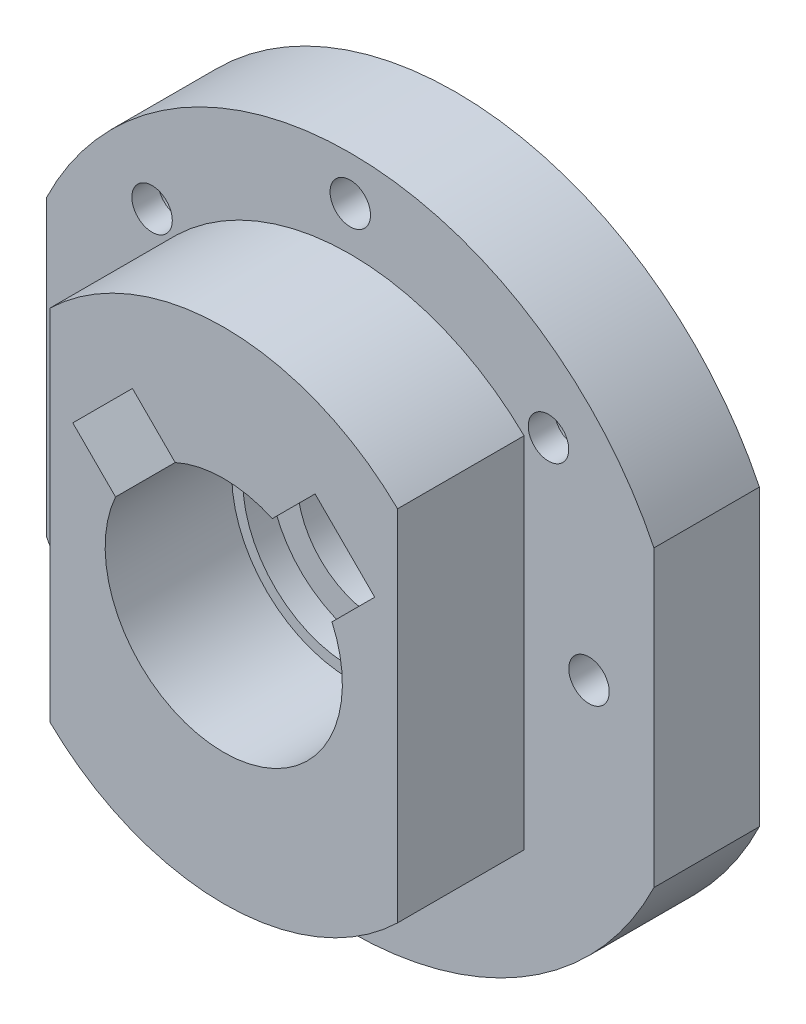
ISO-10303-21;
HEADER;
FILE_DESCRIPTION(('STEP AP214'),'2;1');
FILE_NAME('part.step','',(''),(''),'','','');
FILE_SCHEMA(('AUTOMOTIVE_DESIGN { 1 0 10303 214 1 1 1 1 }'));
ENDSEC;
DATA;
#1=APPLICATION_CONTEXT('core data for automotive mechanical design processes');
#2=APPLICATION_PROTOCOL_DEFINITION('international standard','automotive_design',2000,#1);
#3=PRODUCT_CONTEXT('',#1,'mechanical');
#4=PRODUCT('Part','Part','',(#3));
#5=PRODUCT_RELATED_PRODUCT_CATEGORY('part','',(#4));
#6=PRODUCT_DEFINITION_FORMATION('','',#4);
#7=PRODUCT_DEFINITION_CONTEXT('part definition',#1,'design');
#8=PRODUCT_DEFINITION('design','',#6,#7);
#9=PRODUCT_DEFINITION_SHAPE('','',#8);
#10=(LENGTH_UNIT() NAMED_UNIT(*) SI_UNIT(.MILLI.,.METRE.));
#11=(NAMED_UNIT(*) PLANE_ANGLE_UNIT() SI_UNIT($,.RADIAN.));
#12=(NAMED_UNIT(*) SI_UNIT($,.STERADIAN.) SOLID_ANGLE_UNIT());
#13=UNCERTAINTY_MEASURE_WITH_UNIT(LENGTH_MEASURE(1.E-05),#10,'distance_accuracy_value','');
#14=(GEOMETRIC_REPRESENTATION_CONTEXT(3) GLOBAL_UNCERTAINTY_ASSIGNED_CONTEXT((#13)) GLOBAL_UNIT_ASSIGNED_CONTEXT((#10,
#11,#12)) REPRESENTATION_CONTEXT('',''));
#15=CARTESIAN_POINT('',(0.,0.,0.));
#16=DIRECTION('',(0.,0.,1.));
#17=DIRECTION('',(1.,0.,0.));
#18=AXIS2_PLACEMENT_3D('',#15,#16,#17);
#19=CARTESIAN_POINT('',(5.50040687416928,9.09250932257285,-7.9375));
#20=DIRECTION('',(-0.707106781187582,-0.707106781185513,0.));
#21=DIRECTION('',(0.707106781185513,-0.707106781187582,0.));
#22=AXIS2_PLACEMENT_3D('',#19,#20,#21);
#23=PLANE('',#22);
#24=DIRECTION('',(0.707106781185515,-0.70710678118758,0.));
#25=VECTOR('',#24,1.);
#26=CARTESIAN_POINT('',(5.50040687416925,9.09250932257285,-0.317499999999994));
#27=LINE('',#26,#25);
#28=CARTESIAN_POINT('',(5.50040687416925,9.09250932257286,-0.317499999999994));
#29=VERTEX_POINT('',#28);
#30=CARTESIAN_POINT('',(9.09250932258649,5.50040687414512,-0.317499999999992));
#31=VERTEX_POINT('',#30);
#32=EDGE_CURVE('E125',#29,#31,#27,.T.);
#33=ORIENTED_EDGE('',*,*,#32,.F.);
#34=DIRECTION('',(0.,0.,1.));
#35=VECTOR('',#34,1.);
#36=CARTESIAN_POINT('',(5.50040687416926,9.09250932257286,-7.9375));
#37=LINE('',#36,#35);
#38=CARTESIAN_POINT('',(5.50040687416927,9.09250932257285,-7.9375));
#39=VERTEX_POINT('',#38);
#40=EDGE_CURVE('E138',#39,#29,#37,.T.);
#41=ORIENTED_EDGE('',*,*,#40,.F.);
#42=DIRECTION('',(0.707106781185515,-0.70710678118758,0.));
#43=VECTOR('',#42,1.);
#44=CARTESIAN_POINT('',(5.50040687416928,9.09250932257285,-7.9375));
#45=LINE('',#44,#43);
#46=CARTESIAN_POINT('',(9.09250932258651,5.50040687414512,-7.93749999999999));
#47=VERTEX_POINT('',#46);
#48=EDGE_CURVE('E137',#39,#47,#45,.T.);
#49=ORIENTED_EDGE('',*,*,#48,.T.);
#50=DIRECTION('',(0.,0.,1.));
#51=VECTOR('',#50,1.);
#52=CARTESIAN_POINT('',(9.0925093225865,5.50040687414511,-7.9375));
#53=LINE('',#52,#51);
#54=EDGE_CURVE('E121',#31,#47,#53,.F.);
#55=ORIENTED_EDGE('',*,*,#54,.F.);
#56=EDGE_LOOP('',(#33,#41,#49,#55));
#57=FACE_BOUND('',#56,.T.);
#58=ADVANCED_FACE('F16',(#57),#23,.T.);
#59=CARTESIAN_POINT('',(9.09250932258651,5.50040687414512,-7.9375));
#60=DIRECTION('',(-0.707106781185299,0.707106781187796,0.));
#61=DIRECTION('',(-0.707106781187796,-0.707106781185299,0.));
#62=AXIS2_PLACEMENT_3D('',#59,#60,#61);
#63=PLANE('',#62);
#64=DIRECTION('',(-0.707106781187793,-0.707106781185303,0.));
#65=VECTOR('',#64,1.);
#66=CARTESIAN_POINT('',(9.09250932258649,5.50040687414512,-0.317499999999991));
#67=LINE('',#66,#65);
#68=CARTESIAN_POINT('',(6.51736269786849,2.92526024943633,-0.317499999999995));
#69=VERTEX_POINT('',#68);
#70=EDGE_CURVE('E148',#31,#69,#67,.T.);
#71=ORIENTED_EDGE('',*,*,#70,.F.);
#72=ORIENTED_EDGE('',*,*,#54,.T.);
#73=DIRECTION('',(-0.707106781187796,-0.707106781185299,0.));
#74=VECTOR('',#73,1.);
#75=CARTESIAN_POINT('',(9.09250932258651,5.50040687414512,-7.93749999999999));
#76=LINE('',#75,#74);
#77=CARTESIAN_POINT('',(6.5173626978685,2.92526024943633,-7.93749999999999));
#78=VERTEX_POINT('',#77);
#79=EDGE_CURVE('E143',#47,#78,#76,.T.);
#80=ORIENTED_EDGE('',*,*,#79,.T.);
#81=DIRECTION('',(0.,0.,1.));
#82=VECTOR('',#81,1.);
#83=CARTESIAN_POINT('',(6.51736269786846,2.92526024943642,-7.93749999999999));
#84=LINE('',#83,#82);
#85=EDGE_CURVE('E111',#78,#69,#84,.T.);
#86=ORIENTED_EDGE('',*,*,#85,.T.);
#87=EDGE_LOOP('',(#71,#72,#80,#86));
#88=FACE_BOUND('',#87,.T.);
#89=ADVANCED_FACE('F146',(#88),#63,.T.);
#90=CARTESIAN_POINT('',(0.,0.,-7.9375));
#91=DIRECTION('',(0.,0.,1.));
#92=DIRECTION('',(1.,0.,0.));
#93=AXIS2_PLACEMENT_3D('',#90,#91,#92);
#94=CYLINDRICAL_SURFACE('',#93,7.14375);
#95=DIRECTION('',(0.,0.,1.));
#96=VECTOR('',#95,1.);
#97=CARTESIAN_POINT('',(-6.51736269786507,2.92526024944395,-7.9375));
#98=LINE('',#97,#96);
#99=CARTESIAN_POINT('',(-6.51736269786507,2.92526024944395,-0.317500000000004));
#100=VERTEX_POINT('',#99);
#101=CARTESIAN_POINT('',(-6.51736269786507,2.92526024944395,-7.9375));
#102=VERTEX_POINT('',#101);
#103=EDGE_CURVE('E215',#100,#102,#98,.F.);
#104=ORIENTED_EDGE('',*,*,#103,.F.);
#105=CARTESIAN_POINT('',(0.,0.,-0.317499999999999));
#106=DIRECTION('',(0.,0.,1.));
#107=DIRECTION('',(1.,0.,0.));
#108=AXIS2_PLACEMENT_3D('',#105,#106,#107);
#109=CIRCLE('',#108,7.14375);
#110=EDGE_CURVE('E19',#69,#100,#109,.F.);
#111=ORIENTED_EDGE('',*,*,#110,.F.);
#112=ORIENTED_EDGE('',*,*,#85,.F.);
#113=CARTESIAN_POINT('',(0.,0.,-7.93749999999999));
#114=DIRECTION('',(0.,0.,1.));
#115=DIRECTION('',(1.,0.,0.));
#116=AXIS2_PLACEMENT_3D('',#113,#114,#115);
#117=CIRCLE('',#116,7.14375);
#118=EDGE_CURVE('E154',#78,#102,#117,.F.);
#119=ORIENTED_EDGE('',*,*,#118,.T.);
#120=EDGE_LOOP('',(#104,#111,#112,#119));
#121=FACE_BOUND('',#120,.T.);
#122=ADVANCED_FACE('F352',(#121),#94,.F.);
#123=CARTESIAN_POINT('',(-6.51736269786507,2.92526024944395,-7.9375));
#124=DIRECTION('',(0.707106781186548,0.707106781186547,0.));
#125=DIRECTION('',(-0.707106781186547,0.707106781186548,0.));
#126=AXIS2_PLACEMENT_3D('',#123,#124,#125);
#127=PLANE('',#126);
#128=DIRECTION('',(-0.707106781186548,0.707106781186548,0.));
#129=VECTOR('',#128,1.);
#130=CARTESIAN_POINT('',(-6.51736269786507,2.92526024944395,-0.317500000000002));
#131=LINE('',#130,#129);
#132=CARTESIAN_POINT('',(-9.09250932257925,5.50040687415812,-0.317500000000003));
#133=VERTEX_POINT('',#132);
#134=EDGE_CURVE('E180',#100,#133,#131,.T.);
#135=ORIENTED_EDGE('',*,*,#134,.F.);
#136=ORIENTED_EDGE('',*,*,#103,.T.);
#137=DIRECTION('',(-0.707106781186544,0.707106781186551,0.));
#138=VECTOR('',#137,1.);
#139=CARTESIAN_POINT('',(-6.51736269786507,2.92526024944395,-7.93750000000001));
#140=LINE('',#139,#138);
#141=CARTESIAN_POINT('',(-9.09250932257923,5.50040687415812,-7.93750000000001));
#142=VERTEX_POINT('',#141);
#143=EDGE_CURVE('E156',#102,#142,#140,.T.);
#144=ORIENTED_EDGE('',*,*,#143,.T.);
#145=DIRECTION('',(0.,0.,1.));
#146=VECTOR('',#145,1.);
#147=CARTESIAN_POINT('',(-9.09250932257924,5.50040687415812,-7.9375));
#148=LINE('',#147,#146);
#149=EDGE_CURVE('E205',#133,#142,#148,.F.);
#150=ORIENTED_EDGE('',*,*,#149,.F.);
#151=EDGE_LOOP('',(#135,#136,#144,#150));
#152=FACE_BOUND('',#151,.T.);
#153=ADVANCED_FACE('F342',(#152),#127,.T.);
#154=CARTESIAN_POINT('',(-9.09250932257922,5.50040687415813,-7.9375));
#155=DIRECTION('',(0.707106781186549,-0.707106781186546,0.));
#156=DIRECTION('',(0.707106781186546,0.707106781186549,0.));
#157=AXIS2_PLACEMENT_3D('',#154,#155,#156);
#158=PLANE('',#157);
#159=DIRECTION('',(0.707106781186548,0.707106781186547,0.));
#160=VECTOR('',#159,1.);
#161=CARTESIAN_POINT('',(-9.09250932257925,5.50040687415813,-0.317500000000004));
#162=LINE('',#161,#160);
#163=CARTESIAN_POINT('',(-5.50040687415727,9.09250932258011,-0.317499999999998));
#164=VERTEX_POINT('',#163);
#165=EDGE_CURVE('E177',#133,#164,#162,.T.);
#166=ORIENTED_EDGE('',*,*,#165,.F.);
#167=ORIENTED_EDGE('',*,*,#149,.T.);
#168=DIRECTION('',(0.707106781186545,0.70710678118655,0.));
#169=VECTOR('',#168,1.);
#170=CARTESIAN_POINT('',(-9.09250932257922,5.50040687415813,-7.93750000000001));
#171=LINE('',#170,#169);
#172=CARTESIAN_POINT('',(-5.50040687415726,9.09250932258011,-7.9375));
#173=VERTEX_POINT('',#172);
#174=EDGE_CURVE('E208',#142,#173,#171,.T.);
#175=ORIENTED_EDGE('',*,*,#174,.T.);
#176=DIRECTION('',(0.,0.,1.));
#177=VECTOR('',#176,1.);
#178=CARTESIAN_POINT('',(-5.50040687415726,9.09250932258011,-7.9375));
#179=LINE('',#178,#177);
#180=EDGE_CURVE('E202',#164,#173,#179,.F.);
#181=ORIENTED_EDGE('',*,*,#180,.F.);
#182=EDGE_LOOP('',(#166,#167,#175,#181));
#183=FACE_BOUND('',#182,.T.);
#184=ADVANCED_FACE('F346',(#183),#158,.T.);
#185=CARTESIAN_POINT('',(-5.50040687415726,9.09250932258011,-7.9375));
#186=DIRECTION('',(-0.707106781186195,-0.7071067811869,0.));
#187=DIRECTION('',(0.7071067811869,-0.707106781186195,0.));
#188=AXIS2_PLACEMENT_3D('',#185,#186,#187);
#189=PLANE('',#188);
#190=DIRECTION('',(0.7071067811869,-0.707106781186195,0.));
#191=VECTOR('',#190,1.);
#192=CARTESIAN_POINT('',(-5.50040687415726,9.09250932258011,-0.317500000000001));
#193=LINE('',#192,#191);
#194=CARTESIAN_POINT('',(-2.92526024944099,6.5173626978664,-0.3175));
#195=VERTEX_POINT('',#194);
#196=EDGE_CURVE('E174',#164,#195,#193,.T.);
#197=ORIENTED_EDGE('',*,*,#196,.F.);
#198=ORIENTED_EDGE('',*,*,#180,.T.);
#199=DIRECTION('',(0.7071067811869,-0.707106781186195,0.));
#200=VECTOR('',#199,1.);
#201=CARTESIAN_POINT('',(-5.50040687415726,9.09250932258011,-7.9375));
#202=LINE('',#201,#200);
#203=CARTESIAN_POINT('',(-2.92526024944099,6.5173626978664,-7.9375));
#204=VERTEX_POINT('',#203);
#205=EDGE_CURVE('E210',#173,#204,#202,.T.);
#206=ORIENTED_EDGE('',*,*,#205,.T.);
#207=DIRECTION('',(0.,0.,1.));
#208=VECTOR('',#207,1.);
#209=CARTESIAN_POINT('',(-2.92526024944098,6.5173626978664,-7.9375));
#210=LINE('',#209,#208);
#211=EDGE_CURVE('E196',#204,#195,#210,.T.);
#212=ORIENTED_EDGE('',*,*,#211,.T.);
#213=EDGE_LOOP('',(#197,#198,#206,#212));
#214=FACE_BOUND('',#213,.T.);
#215=ADVANCED_FACE('F349',(#214),#189,.T.);
#216=CARTESIAN_POINT('',(0.,0.,-7.9375));
#217=DIRECTION('',(0.,0.,1.));
#218=DIRECTION('',(1.,0.,0.));
#219=AXIS2_PLACEMENT_3D('',#216,#217,#218);
#220=CYLINDRICAL_SURFACE('',#219,7.14375);
#221=DIRECTION('',(0.,0.,1.));
#222=VECTOR('',#221,1.);
#223=CARTESIAN_POINT('',(2.92526024944959,6.51736269786253,-7.9375));
#224=LINE('',#223,#222);
#225=CARTESIAN_POINT('',(2.92526024944959,6.51736269786254,-0.317499999999997));
#226=VERTEX_POINT('',#225);
#227=CARTESIAN_POINT('',(2.92526024944959,6.51736269786254,-7.9375));
#228=VERTEX_POINT('',#227);
#229=EDGE_CURVE('E192',#226,#228,#224,.F.);
#230=ORIENTED_EDGE('',*,*,#229,.F.);
#231=CARTESIAN_POINT('',(0.,0.,-0.317499999999998));
#232=DIRECTION('',(0.,0.,1.));
#233=DIRECTION('',(1.,0.,0.));
#234=AXIS2_PLACEMENT_3D('',#231,#232,#233);
#235=CIRCLE('',#234,7.14375);
#236=EDGE_CURVE('E171',#195,#226,#235,.F.);
#237=ORIENTED_EDGE('',*,*,#236,.F.);
#238=ORIENTED_EDGE('',*,*,#211,.F.);
#239=CARTESIAN_POINT('',(0.,0.,-7.9375));
#240=DIRECTION('',(0.,0.,1.));
#241=DIRECTION('',(1.,0.,0.));
#242=AXIS2_PLACEMENT_3D('',#239,#240,#241);
#243=CIRCLE('',#242,7.14375);
#244=EDGE_CURVE('E319',#204,#228,#243,.F.);
#245=ORIENTED_EDGE('',*,*,#244,.T.);
#246=EDGE_LOOP('',(#230,#237,#238,#245));
#247=FACE_BOUND('',#246,.T.);
#248=ADVANCED_FACE('F329',(#247),#220,.F.);
#249=CARTESIAN_POINT('',(2.92526024944959,6.51736269786253,-7.9375));
#250=DIRECTION('',(0.707106781185265,-0.70710678118783,0.));
#251=DIRECTION('',(0.70710678118783,0.707106781185265,0.));
#252=AXIS2_PLACEMENT_3D('',#249,#250,#251);
#253=PLANE('',#252);
#254=DIRECTION('',(0.707106781187831,0.707106781185264,0.));
#255=VECTOR('',#254,1.);
#256=CARTESIAN_POINT('',(2.92526024944959,6.51736269786253,-0.317499999999995));
#257=LINE('',#256,#255);
#258=EDGE_CURVE('E144',#226,#29,#257,.T.);
#259=ORIENTED_EDGE('',*,*,#258,.F.);
#260=ORIENTED_EDGE('',*,*,#229,.T.);
#261=DIRECTION('',(0.707106781187834,0.707106781185261,0.));
#262=VECTOR('',#261,1.);
#263=CARTESIAN_POINT('',(2.92526024944959,6.51736269786253,-7.9375));
#264=LINE('',#263,#262);
#265=EDGE_CURVE('E191',#228,#39,#264,.T.);
#266=ORIENTED_EDGE('',*,*,#265,.T.);
#267=ORIENTED_EDGE('',*,*,#40,.T.);
#268=EDGE_LOOP('',(#259,#260,#266,#267));
#269=FACE_BOUND('',#268,.T.);
#270=ADVANCED_FACE('F331',(#269),#253,.T.);
#271=CARTESIAN_POINT('',(0.,0.,-0.317499999999997));
#272=DIRECTION('',(0.,0.,1.));
#273=DIRECTION('',(1.,0.,0.));
#274=AXIS2_PLACEMENT_3D('',#271,#272,#273);
#275=PLANE('',#274);
#276=ORIENTED_EDGE('',*,*,#236,.T.);
#277=ORIENTED_EDGE('',*,*,#258,.T.);
#278=ORIENTED_EDGE('',*,*,#32,.T.);
#279=ORIENTED_EDGE('',*,*,#70,.T.);
#280=ORIENTED_EDGE('',*,*,#110,.T.);
#281=ORIENTED_EDGE('',*,*,#134,.T.);
#282=ORIENTED_EDGE('',*,*,#165,.T.);
#283=ORIENTED_EDGE('',*,*,#196,.T.);
#284=EDGE_LOOP('',(#276,#277,#278,#279,#280,#281,#282,#283));
#285=FACE_BOUND('',#284,.T.);
#286=DIRECTION('',(0.,1.,0.));
#287=VECTOR('',#286,1.);
#288=CARTESIAN_POINT('',(-10.468,10.7991933032056,-0.317500000000005));
#289=LINE('',#288,#287);
#290=CARTESIAN_POINT('',(-10.468,-10.7991933032056,-0.317500000000005));
#291=VERTEX_POINT('',#290);
#292=CARTESIAN_POINT('',(-10.468,10.7991933032056,-0.317500000000005));
#293=VERTEX_POINT('',#292);
#294=EDGE_CURVE('E164',#291,#293,#289,.T.);
#295=ORIENTED_EDGE('',*,*,#294,.F.);
#296=CARTESIAN_POINT('',(0.,0.,-0.317499999999997));
#297=DIRECTION('',(0.,0.,1.));
#298=DIRECTION('',(1.,0.,0.));
#299=AXIS2_PLACEMENT_3D('',#296,#297,#298);
#300=CIRCLE('',#299,15.04);
#301=CARTESIAN_POINT('',(10.468,-10.7991933032056,-0.31749999999999));
#302=VERTEX_POINT('',#301);
#303=EDGE_CURVE('E313',#302,#291,#300,.F.);
#304=ORIENTED_EDGE('',*,*,#303,.F.);
#305=DIRECTION('',(0.,1.,0.));
#306=VECTOR('',#305,1.);
#307=CARTESIAN_POINT('',(10.468,-10.7991933032056,-0.31749999999999));
#308=LINE('',#307,#306);
#309=CARTESIAN_POINT('',(10.468,10.7991933032056,-0.31749999999999));
#310=VERTEX_POINT('',#309);
#311=EDGE_CURVE('E188',#310,#302,#308,.F.);
#312=ORIENTED_EDGE('',*,*,#311,.F.);
#313=CARTESIAN_POINT('',(0.,0.,-0.317499999999997));
#314=DIRECTION('',(0.,0.,1.));
#315=DIRECTION('',(1.,0.,0.));
#316=AXIS2_PLACEMENT_3D('',#313,#314,#315);
#317=CIRCLE('',#316,15.04);
#318=EDGE_CURVE('E190',#293,#310,#317,.F.);
#319=ORIENTED_EDGE('',*,*,#318,.F.);
#320=EDGE_LOOP('',(#295,#304,#312,#319));
#321=FACE_BOUND('',#320,.T.);
#322=ADVANCED_FACE('F323',(#285,#321),#275,.T.);
#323=CARTESIAN_POINT('',(0.,0.,-7.9375));
#324=DIRECTION('',(0.,0.,-1.));
#325=DIRECTION('',(-1.,0.,0.));
#326=AXIS2_PLACEMENT_3D('',#323,#324,#325);
#327=PLANE('',#326);
#328=CARTESIAN_POINT('',(0.,0.,-7.93750000000001));
#329=DIRECTION('',(0.,0.,-1.));
#330=DIRECTION('',(-1.,0.,0.));
#331=AXIS2_PLACEMENT_3D('',#328,#329,#330);
#332=CIRCLE('',#331,6.477);
#333=CARTESIAN_POINT('',(-6.477,0.,-7.93750000000001));
#334=VERTEX_POINT('',#333);
#335=EDGE_CURVE('E309',#334,#334,#332,.T.);
#336=ORIENTED_EDGE('',*,*,#335,.T.);
#337=EDGE_LOOP('',(#336));
#338=FACE_BOUND('',#337,.T.);
#339=ORIENTED_EDGE('',*,*,#244,.F.);
#340=ORIENTED_EDGE('',*,*,#205,.F.);
#341=ORIENTED_EDGE('',*,*,#174,.F.);
#342=ORIENTED_EDGE('',*,*,#143,.F.);
#343=ORIENTED_EDGE('',*,*,#118,.F.);
#344=ORIENTED_EDGE('',*,*,#79,.F.);
#345=ORIENTED_EDGE('',*,*,#48,.F.);
#346=ORIENTED_EDGE('',*,*,#265,.F.);
#347=EDGE_LOOP('',(#339,#340,#341,#342,#343,#344,#345,#346));
#348=FACE_BOUND('',#347,.T.);
#349=ADVANCED_FACE('F152',(#338,#348),#327,.F.);
#350=CARTESIAN_POINT('',(10.468,-10.7991933032056,-7.9375));
#351=DIRECTION('',(1.,0.,0.));
#352=DIRECTION('',(0.,0.,-1.));
#353=AXIS2_PLACEMENT_3D('',#350,#351,#352);
#354=PLANE('',#353);
#355=ORIENTED_EDGE('',*,*,#311,.T.);
#356=DIRECTION('',(0.,0.,1.));
#357=VECTOR('',#356,1.);
#358=CARTESIAN_POINT('',(10.468,-10.7991933032056,-7.93749999999999));
#359=LINE('',#358,#357);
#360=CARTESIAN_POINT('',(10.468,-10.7991933032056,-7.93749999999999));
#361=VERTEX_POINT('',#360);
#362=EDGE_CURVE('E316',#361,#302,#359,.T.);
#363=ORIENTED_EDGE('',*,*,#362,.F.);
#364=DIRECTION('',(0.,1.,0.));
#365=VECTOR('',#364,1.);
#366=CARTESIAN_POINT('',(10.468,0.,-7.93749999999999));
#367=LINE('',#366,#365);
#368=CARTESIAN_POINT('',(10.468,10.7991933032056,-7.9375));
#369=VERTEX_POINT('',#368);
#370=EDGE_CURVE('E302',#361,#369,#367,.T.);
#371=ORIENTED_EDGE('',*,*,#370,.T.);
#372=DIRECTION('',(0.,0.,1.));
#373=VECTOR('',#372,1.);
#374=CARTESIAN_POINT('',(10.468,10.7991933032056,-7.93749999999999));
#375=LINE('',#374,#373);
#376=EDGE_CURVE('E168',#310,#369,#375,.F.);
#377=ORIENTED_EDGE('',*,*,#376,.F.);
#378=EDGE_LOOP('',(#355,#363,#371,#377));
#379=FACE_BOUND('',#378,.T.);
#380=ADVANCED_FACE('F467',(#379),#354,.T.);
#381=CARTESIAN_POINT('',(0.,0.,-7.9375));
#382=DIRECTION('',(0.,0.,1.));
#383=DIRECTION('',(1.,0.,0.));
#384=AXIS2_PLACEMENT_3D('',#381,#382,#383);
#385=CYLINDRICAL_SURFACE('',#384,15.04);
#386=ORIENTED_EDGE('',*,*,#318,.T.);
#387=ORIENTED_EDGE('',*,*,#376,.T.);
#388=CARTESIAN_POINT('',(0.,0.,-7.93750000000001));
#389=DIRECTION('',(0.,0.,1.));
#390=DIRECTION('',(1.,0.,0.));
#391=AXIS2_PLACEMENT_3D('',#388,#389,#390);
#392=CIRCLE('',#391,15.04);
#393=CARTESIAN_POINT('',(-10.468,10.7991933032056,-7.93750000000001));
#394=VERTEX_POINT('',#393);
#395=EDGE_CURVE('E300',#369,#394,#392,.T.);
#396=ORIENTED_EDGE('',*,*,#395,.T.);
#397=DIRECTION('',(0.,0.,1.));
#398=VECTOR('',#397,1.);
#399=CARTESIAN_POINT('',(-10.468,10.7991933032056,-7.9375));
#400=LINE('',#399,#398);
#401=EDGE_CURVE('E167',#293,#394,#400,.F.);
#402=ORIENTED_EDGE('',*,*,#401,.F.);
#403=EDGE_LOOP('',(#386,#387,#396,#402));
#404=FACE_BOUND('',#403,.T.);
#405=ADVANCED_FACE('F463',(#404),#385,.T.);
#406=CARTESIAN_POINT('',(-10.468,10.7991933032056,-7.9375));
#407=DIRECTION('',(-1.,0.,0.));
#408=DIRECTION('',(0.,0.,1.));
#409=AXIS2_PLACEMENT_3D('',#406,#407,#408);
#410=PLANE('',#409);
#411=ORIENTED_EDGE('',*,*,#294,.T.);
#412=ORIENTED_EDGE('',*,*,#401,.T.);
#413=DIRECTION('',(0.,1.,0.));
#414=VECTOR('',#413,1.);
#415=CARTESIAN_POINT('',(-10.468,0.,-7.93750000000001));
#416=LINE('',#415,#414);
#417=CARTESIAN_POINT('',(-10.468,-10.7991933032056,-7.9375));
#418=VERTEX_POINT('',#417);
#419=EDGE_CURVE('E299',#394,#418,#416,.F.);
#420=ORIENTED_EDGE('',*,*,#419,.T.);
#421=DIRECTION('',(0.,0.,1.));
#422=VECTOR('',#421,1.);
#423=CARTESIAN_POINT('',(-10.468,-10.7991933032056,-7.93750000000001));
#424=LINE('',#423,#422);
#425=EDGE_CURVE('E312',#291,#418,#424,.F.);
#426=ORIENTED_EDGE('',*,*,#425,.F.);
#427=EDGE_LOOP('',(#411,#412,#420,#426));
#428=FACE_BOUND('',#427,.T.);
#429=ADVANCED_FACE('F459',(#428),#410,.T.);
#430=CARTESIAN_POINT('',(0.,0.,-7.9375));
#431=DIRECTION('',(0.,0.,1.));
#432=DIRECTION('',(1.,0.,0.));
#433=AXIS2_PLACEMENT_3D('',#430,#431,#432);
#434=CYLINDRICAL_SURFACE('',#433,15.04);
#435=ORIENTED_EDGE('',*,*,#303,.T.);
#436=ORIENTED_EDGE('',*,*,#425,.T.);
#437=CARTESIAN_POINT('',(0.,0.,-7.93749999999999));
#438=DIRECTION('',(0.,0.,1.));
#439=DIRECTION('',(1.,0.,0.));
#440=AXIS2_PLACEMENT_3D('',#437,#438,#439);
#441=CIRCLE('',#440,15.04);
#442=EDGE_CURVE('E296',#418,#361,#441,.T.);
#443=ORIENTED_EDGE('',*,*,#442,.T.);
#444=ORIENTED_EDGE('',*,*,#362,.T.);
#445=EDGE_LOOP('',(#435,#436,#443,#444));
#446=FACE_BOUND('',#445,.T.);
#447=ADVANCED_FACE('F455',(#446),#434,.T.);
#448=CARTESIAN_POINT('',(11.938,11.43,-8.03274999999997));
#449=DIRECTION('',(0.,0.,1.));
#450=DIRECTION('',(1.,0.,0.));
#451=AXIS2_PLACEMENT_3D('',#448,#449,#450);
#452=CYLINDRICAL_SURFACE('',#451,1.2192);
#453=CARTESIAN_POINT('',(11.938,11.43,-7.9375));
#454=DIRECTION('',(0.,0.,1.));
#455=DIRECTION('',(1.,0.,0.));
#456=AXIS2_PLACEMENT_3D('',#453,#454,#455);
#457=CIRCLE('',#456,1.2192);
#458=CARTESIAN_POINT('',(13.1572,11.43,-7.9375));
#459=VERTEX_POINT('',#458);
#460=EDGE_CURVE('E306',#459,#459,#457,.T.);
#461=ORIENTED_EDGE('',*,*,#460,.T.);
#462=EDGE_LOOP('',(#461));
#463=FACE_BOUND('',#462,.T.);
#464=CARTESIAN_POINT('',(11.938,11.43,-9.52499999999997));
#465=DIRECTION('',(0.,0.,1.));
#466=DIRECTION('',(1.,0.,0.));
#467=AXIS2_PLACEMENT_3D('',#464,#465,#466);
#468=CIRCLE('',#467,1.2192);
#469=CARTESIAN_POINT('',(13.1572,11.43,-9.52499999999997));
#470=VERTEX_POINT('',#469);
#471=EDGE_CURVE('E281',#470,#470,#468,.T.);
#472=ORIENTED_EDGE('',*,*,#471,.F.);
#473=EDGE_LOOP('',(#472));
#474=FACE_BOUND('',#473,.T.);
#475=ADVANCED_FACE('F451',(#463,#474),#452,.F.);
#476=CARTESIAN_POINT('',(-11.938,11.43,-8.03275));
#477=DIRECTION('',(0.,0.,1.));
#478=DIRECTION('',(1.,0.,0.));
#479=AXIS2_PLACEMENT_3D('',#476,#477,#478);
#480=CYLINDRICAL_SURFACE('',#479,1.2192);
#481=CARTESIAN_POINT('',(-11.938,11.43,-7.9375));
#482=DIRECTION('',(0.,0.,1.));
#483=DIRECTION('',(1.,0.,0.));
#484=AXIS2_PLACEMENT_3D('',#481,#482,#483);
#485=CIRCLE('',#484,1.2192);
#486=CARTESIAN_POINT('',(-10.7188,11.43,-7.9375));
#487=VERTEX_POINT('',#486);
#488=EDGE_CURVE('E303',#487,#487,#485,.T.);
#489=ORIENTED_EDGE('',*,*,#488,.T.);
#490=EDGE_LOOP('',(#489));
#491=FACE_BOUND('',#490,.T.);
#492=CARTESIAN_POINT('',(-11.938,11.43,-9.525));
#493=DIRECTION('',(0.,0.,1.));
#494=DIRECTION('',(1.,0.,0.));
#495=AXIS2_PLACEMENT_3D('',#492,#493,#494);
#496=CIRCLE('',#495,1.2192);
#497=CARTESIAN_POINT('',(-10.7188,11.43,-9.525));
#498=VERTEX_POINT('',#497);
#499=EDGE_CURVE('E278',#498,#498,#496,.T.);
#500=ORIENTED_EDGE('',*,*,#499,.F.);
#501=EDGE_LOOP('',(#500));
#502=FACE_BOUND('',#501,.T.);
#503=ADVANCED_FACE('F447',(#491,#502),#480,.F.);
#504=CARTESIAN_POINT('',(0.,0.,-7.9375));
#505=DIRECTION('',(0.,0.,-1.));
#506=DIRECTION('',(-1.,0.,0.));
#507=AXIS2_PLACEMENT_3D('',#504,#505,#506);
#508=CYLINDRICAL_SURFACE('',#507,6.477);
#509=CARTESIAN_POINT('',(0.,0.,-9.525));
#510=DIRECTION('',(0.,0.,-1.));
#511=DIRECTION('',(-1.,0.,0.));
#512=AXIS2_PLACEMENT_3D('',#509,#510,#511);
#513=CIRCLE('',#512,6.477);
#514=CARTESIAN_POINT('',(-6.47699999999999,0.,-9.52500000000001));
#515=VERTEX_POINT('',#514);
#516=EDGE_CURVE('E275',#515,#515,#513,.F.);
#517=ORIENTED_EDGE('',*,*,#516,.F.);
#518=EDGE_LOOP('',(#517));
#519=FACE_BOUND('',#518,.T.);
#520=ORIENTED_EDGE('',*,*,#335,.F.);
#521=EDGE_LOOP('',(#520));
#522=FACE_BOUND('',#521,.T.);
#523=ADVANCED_FACE('F443',(#519,#522),#508,.F.);
#524=CARTESIAN_POINT('',(0.,0.,-7.9375));
#525=DIRECTION('',(0.,0.,-1.));
#526=DIRECTION('',(-1.,0.,0.));
#527=AXIS2_PLACEMENT_3D('',#524,#525,#526);
#528=PLANE('',#527);
#529=ORIENTED_EDGE('',*,*,#419,.F.);
#530=ORIENTED_EDGE('',*,*,#395,.F.);
#531=ORIENTED_EDGE('',*,*,#370,.F.);
#532=ORIENTED_EDGE('',*,*,#442,.F.);
#533=EDGE_LOOP('',(#529,#530,#531,#532));
#534=FACE_BOUND('',#533,.T.);
#535=ORIENTED_EDGE('',*,*,#488,.F.);
#536=EDGE_LOOP('',(#535));
#537=FACE_BOUND('',#536,.T.);
#538=ORIENTED_EDGE('',*,*,#460,.F.);
#539=EDGE_LOOP('',(#538));
#540=FACE_BOUND('',#539,.T.);
#541=CARTESIAN_POINT('',(0.,17.68,-7.9375));
#542=DIRECTION('',(0.,0.,1.));
#543=DIRECTION('',(1.,0.,0.));
#544=AXIS2_PLACEMENT_3D('',#541,#542,#543);
#545=CIRCLE('',#544,1.2192);
#546=CARTESIAN_POINT('',(1.2192,17.68,-7.9375));
#547=VERTEX_POINT('',#546);
#548=EDGE_CURVE('E284',#547,#547,#545,.F.);
#549=ORIENTED_EDGE('',*,*,#548,.T.);
#550=EDGE_LOOP('',(#549));
#551=FACE_BOUND('',#550,.T.);
#552=CARTESIAN_POINT('',(0.,-17.68,-7.9375));
#553=DIRECTION('',(0.,0.,1.));
#554=DIRECTION('',(1.,0.,0.));
#555=AXIS2_PLACEMENT_3D('',#552,#553,#554);
#556=CIRCLE('',#555,1.2192);
#557=CARTESIAN_POINT('',(1.21920000000001,-17.68,-7.9375));
#558=VERTEX_POINT('',#557);
#559=EDGE_CURVE('E287',#558,#558,#556,.F.);
#560=ORIENTED_EDGE('',*,*,#559,.T.);
#561=EDGE_LOOP('',(#560));
#562=FACE_BOUND('',#561,.T.);
#563=CARTESIAN_POINT('',(-14.378,0.,-7.9375));
#564=DIRECTION('',(0.,0.,1.));
#565=DIRECTION('',(1.,0.,0.));
#566=AXIS2_PLACEMENT_3D('',#563,#564,#565);
#567=CIRCLE('',#566,1.2192);
#568=CARTESIAN_POINT('',(-13.1588,0.,-7.9375));
#569=VERTEX_POINT('',#568);
#570=EDGE_CURVE('E290',#569,#569,#567,.F.);
#571=ORIENTED_EDGE('',*,*,#570,.T.);
#572=EDGE_LOOP('',(#571));
#573=FACE_BOUND('',#572,.T.);
#574=CARTESIAN_POINT('',(14.378,0.,-7.9375));
#575=DIRECTION('',(0.,0.,1.));
#576=DIRECTION('',(1.,0.,0.));
#577=AXIS2_PLACEMENT_3D('',#574,#575,#576);
#578=CIRCLE('',#577,1.2192);
#579=CARTESIAN_POINT('',(15.5972,0.,-7.9375));
#580=VERTEX_POINT('',#579);
#581=EDGE_CURVE('E293',#580,#580,#578,.F.);
#582=ORIENTED_EDGE('',*,*,#581,.T.);
#583=EDGE_LOOP('',(#582));
#584=FACE_BOUND('',#583,.T.);
#585=CARTESIAN_POINT('',(0.,0.,-7.93749999999999));
#586=DIRECTION('',(0.,0.,-1.));
#587=DIRECTION('',(-1.,0.,0.));
#588=AXIS2_PLACEMENT_3D('',#585,#586,#587);
#589=CIRCLE('',#588,20.32);
#590=CARTESIAN_POINT('',(18.288,-8.85728265327465,-7.93749999999997));
#591=VERTEX_POINT('',#590);
#592=CARTESIAN_POINT('',(-18.288,-8.85728265327466,-7.9375));
#593=VERTEX_POINT('',#592);
#594=EDGE_CURVE('E265',#591,#593,#589,.T.);
#595=ORIENTED_EDGE('',*,*,#594,.F.);
#596=DIRECTION('',(0.,1.,0.));
#597=VECTOR('',#596,1.);
#598=CARTESIAN_POINT('',(18.288,8.85728265327465,-7.93749999999997));
#599=LINE('',#598,#597);
#600=CARTESIAN_POINT('',(18.288,8.85728265327466,-7.93749999999998));
#601=VERTEX_POINT('',#600);
#602=EDGE_CURVE('E728',#601,#591,#599,.F.);
#603=ORIENTED_EDGE('',*,*,#602,.F.);
#604=CARTESIAN_POINT('',(0.,0.,-7.93749999999999));
#605=DIRECTION('',(0.,0.,-1.));
#606=DIRECTION('',(-1.,0.,0.));
#607=AXIS2_PLACEMENT_3D('',#604,#605,#606);
#608=CIRCLE('',#607,20.32);
#609=CARTESIAN_POINT('',(-18.288,8.85728265327465,-7.9375));
#610=VERTEX_POINT('',#609);
#611=EDGE_CURVE('E270',#610,#601,#608,.T.);
#612=ORIENTED_EDGE('',*,*,#611,.F.);
#613=DIRECTION('',(0.,1.,0.));
#614=VECTOR('',#613,1.);
#615=CARTESIAN_POINT('',(-18.288,-8.85728265327468,-7.9375));
#616=LINE('',#615,#614);
#617=EDGE_CURVE('E274',#593,#610,#616,.T.);
#618=ORIENTED_EDGE('',*,*,#617,.F.);
#619=EDGE_LOOP('',(#595,#603,#612,#618));
#620=FACE_BOUND('',#619,.T.);
#621=ADVANCED_FACE('F439',(#534,#537,#540,#551,#562,#573,#584,#620),#528,.F.);
#622=CARTESIAN_POINT('',(14.378,0.,-6.60399999999997));
#623=DIRECTION('',(0.,0.,1.));
#624=DIRECTION('',(1.,0.,0.));
#625=AXIS2_PLACEMENT_3D('',#622,#623,#624);
#626=CYLINDRICAL_SURFACE('',#625,1.2192);
#627=ORIENTED_EDGE('',*,*,#581,.F.);
#628=EDGE_LOOP('',(#627));
#629=FACE_BOUND('',#628,.T.);
#630=CARTESIAN_POINT('',(14.378,0.,-13.2063837709211));
#631=DIRECTION('',(0.,0.,-1.));
#632=DIRECTION('',(-1.,0.,0.));
#633=AXIS2_PLACEMENT_3D('',#630,#631,#632);
#634=CIRCLE('',#633,1.21920000001487);
#635=CARTESIAN_POINT('',(13.1587999999851,0.,-13.2063837709211));
#636=VERTEX_POINT('',#635);
#637=EDGE_CURVE('E732',#636,#636,#634,.T.);
#638=ORIENTED_EDGE('',*,*,#637,.T.);
#639=EDGE_LOOP('',(#638));
#640=FACE_BOUND('',#639,.T.);
#641=ADVANCED_FACE('F435',(#629,#640),#626,.F.);
#642=CARTESIAN_POINT('',(-14.378,0.,-6.604));
#643=DIRECTION('',(0.,0.,1.));
#644=DIRECTION('',(1.,0.,0.));
#645=AXIS2_PLACEMENT_3D('',#642,#643,#644);
#646=CYLINDRICAL_SURFACE('',#645,1.2192);
#647=ORIENTED_EDGE('',*,*,#570,.F.);
#648=EDGE_LOOP('',(#647));
#649=FACE_BOUND('',#648,.T.);
#650=CARTESIAN_POINT('',(-14.378,0.,-13.2063837709211));
#651=DIRECTION('',(0.,0.,-1.));
#652=DIRECTION('',(-1.,0.,0.));
#653=AXIS2_PLACEMENT_3D('',#650,#651,#652);
#654=CIRCLE('',#653,1.21920000000198);
#655=CARTESIAN_POINT('',(-15.597200000002,0.,-13.2063837709211));
#656=VERTEX_POINT('',#655);
#657=EDGE_CURVE('E735',#656,#656,#654,.T.);
#658=ORIENTED_EDGE('',*,*,#657,.T.);
#659=EDGE_LOOP('',(#658));
#660=FACE_BOUND('',#659,.T.);
#661=ADVANCED_FACE('F431',(#649,#660),#646,.F.);
#662=CARTESIAN_POINT('',(0.,-17.68,-6.60399999999997));
#663=DIRECTION('',(0.,0.,1.));
#664=DIRECTION('',(1.,0.,0.));
#665=AXIS2_PLACEMENT_3D('',#662,#663,#664);
#666=CYLINDRICAL_SURFACE('',#665,1.2192);
#667=ORIENTED_EDGE('',*,*,#559,.F.);
#668=EDGE_LOOP('',(#667));
#669=FACE_BOUND('',#668,.T.);
#670=CARTESIAN_POINT('',(0.,-17.68,-13.2063837709779));
#671=DIRECTION('',(0.,0.,-1.));
#672=DIRECTION('',(-1.,0.,0.));
#673=AXIS2_PLACEMENT_3D('',#670,#671,#672);
#674=CIRCLE('',#673,1.21919999998);
#675=CARTESIAN_POINT('',(-1.21919999997999,-17.68,-13.2063837709779));
#676=VERTEX_POINT('',#675);
#677=EDGE_CURVE('E740',#676,#676,#674,.T.);
#678=ORIENTED_EDGE('',*,*,#677,.T.);
#679=EDGE_LOOP('',(#678));
#680=FACE_BOUND('',#679,.T.);
#681=ADVANCED_FACE('F427',(#669,#680),#666,.F.);
#682=CARTESIAN_POINT('',(0.,17.68,-6.60399999999997));
#683=DIRECTION('',(0.,0.,1.));
#684=DIRECTION('',(1.,0.,0.));
#685=AXIS2_PLACEMENT_3D('',#682,#683,#684);
#686=CYLINDRICAL_SURFACE('',#685,1.2192);
#687=ORIENTED_EDGE('',*,*,#548,.F.);
#688=EDGE_LOOP('',(#687));
#689=FACE_BOUND('',#688,.T.);
#690=CARTESIAN_POINT('',(0.,17.68,-13.2063837709211));
#691=DIRECTION('',(0.,0.,-1.));
#692=DIRECTION('',(-1.,0.,0.));
#693=AXIS2_PLACEMENT_3D('',#690,#691,#692);
#694=CIRCLE('',#693,1.21919999997999);
#695=CARTESIAN_POINT('',(-1.21919999997999,17.68,-13.2063837709211));
#696=VERTEX_POINT('',#695);
#697=EDGE_CURVE('E264',#696,#696,#694,.T.);
#698=ORIENTED_EDGE('',*,*,#697,.T.);
#699=EDGE_LOOP('',(#698));
#700=FACE_BOUND('',#699,.T.);
#701=ADVANCED_FACE('F423',(#689,#700),#686,.F.);
#702=CARTESIAN_POINT('',(11.938,11.43,-9.525));
#703=DIRECTION('',(0.,0.,-1.));
#704=DIRECTION('',(-1.,0.,0.));
#705=AXIS2_PLACEMENT_3D('',#702,#703,#704);
#706=PLANE('',#705);
#707=ORIENTED_EDGE('',*,*,#471,.T.);
#708=EDGE_LOOP('',(#707));
#709=FACE_BOUND('',#708,.T.);
#710=CARTESIAN_POINT('',(11.938,11.43,-9.52499999999645));
#711=DIRECTION('',(0.,0.,-1.));
#712=DIRECTION('',(-1.,0.,0.));
#713=AXIS2_PLACEMENT_3D('',#710,#711,#712);
#714=CIRCLE('',#713,1.31250795116438);
#715=CARTESIAN_POINT('',(10.6254920488356,11.43,-9.52499999999645));
#716=VERTEX_POINT('',#715);
#717=EDGE_CURVE('E261',#716,#716,#714,.T.);
#718=ORIENTED_EDGE('',*,*,#717,.T.);
#719=EDGE_LOOP('',(#718));
#720=FACE_BOUND('',#719,.T.);
#721=ADVANCED_FACE('F419',(#709,#720),#706,.T.);
#722=CARTESIAN_POINT('',(-11.938,11.43,-9.525));
#723=DIRECTION('',(0.,0.,-1.));
#724=DIRECTION('',(-1.,0.,0.));
#725=AXIS2_PLACEMENT_3D('',#722,#723,#724);
#726=PLANE('',#725);
#727=ORIENTED_EDGE('',*,*,#499,.T.);
#728=EDGE_LOOP('',(#727));
#729=FACE_BOUND('',#728,.T.);
#730=CARTESIAN_POINT('',(-11.938,11.43,-9.52499999999645));
#731=DIRECTION('',(0.,0.,-1.));
#732=DIRECTION('',(0.,1.,0.));
#733=AXIS2_PLACEMENT_3D('',#730,#731,#732);
#734=CIRCLE('',#733,1.31250795116303);
#735=CARTESIAN_POINT('',(-11.938,12.742507951163,-9.52499999999645));
#736=VERTEX_POINT('',#735);
#737=EDGE_CURVE('E258',#736,#736,#734,.T.);
#738=ORIENTED_EDGE('',*,*,#737,.T.);
#739=EDGE_LOOP('',(#738));
#740=FACE_BOUND('',#739,.T.);
#741=ADVANCED_FACE('F415',(#729,#740),#726,.T.);
#742=CARTESIAN_POINT('',(0.,0.,-9.525));
#743=DIRECTION('',(0.,0.,1.));
#744=DIRECTION('',(1.,0.,0.));
#745=AXIS2_PLACEMENT_3D('',#742,#743,#744);
#746=PLANE('',#745);
#747=CARTESIAN_POINT('',(0.,0.,-9.525));
#748=DIRECTION('',(0.,0.,1.));
#749=DIRECTION('',(1.,0.,0.));
#750=AXIS2_PLACEMENT_3D('',#747,#748,#749);
#751=CIRCLE('',#750,4.7879);
#752=CARTESIAN_POINT('',(4.7879,0.,-9.525));
#753=VERTEX_POINT('',#752);
#754=EDGE_CURVE('E255',#753,#753,#751,.F.);
#755=ORIENTED_EDGE('',*,*,#754,.T.);
#756=EDGE_LOOP('',(#755));
#757=FACE_BOUND('',#756,.T.);
#758=ORIENTED_EDGE('',*,*,#516,.T.);
#759=EDGE_LOOP('',(#758));
#760=FACE_BOUND('',#759,.T.);
#761=ADVANCED_FACE('F411',(#757,#760),#746,.T.);
#762=CARTESIAN_POINT('',(-18.288,-8.85728265327468,-7.9375));
#763=DIRECTION('',(-1.,0.,0.));
#764=DIRECTION('',(0.,0.,1.));
#765=AXIS2_PLACEMENT_3D('',#762,#763,#764);
#766=PLANE('',#765);
#767=DIRECTION('',(0.,1.,0.));
#768=VECTOR('',#767,1.);
#769=CARTESIAN_POINT('',(-18.288,0.,-14.2875));
#770=LINE('',#769,#768);
#771=CARTESIAN_POINT('',(-18.288,-8.85728265327466,-14.2875));
#772=VERTEX_POINT('',#771);
#773=CARTESIAN_POINT('',(-18.288,8.85728265327464,-14.2875));
#774=VERTEX_POINT('',#773);
#775=EDGE_CURVE('E254',#772,#774,#770,.T.);
#776=ORIENTED_EDGE('',*,*,#775,.F.);
#777=DIRECTION('',(0.,0.,-1.));
#778=VECTOR('',#777,1.);
#779=CARTESIAN_POINT('',(-18.288,-8.85728265327468,-7.93750000000001));
#780=LINE('',#779,#778);
#781=EDGE_CURVE('E268',#593,#772,#780,.T.);
#782=ORIENTED_EDGE('',*,*,#781,.F.);
#783=ORIENTED_EDGE('',*,*,#617,.T.);
#784=DIRECTION('',(0.,0.,-1.));
#785=VECTOR('',#784,1.);
#786=CARTESIAN_POINT('',(-18.288,8.85728265327465,-7.93750000000001));
#787=LINE('',#786,#785);
#788=EDGE_CURVE('E273',#774,#610,#787,.F.);
#789=ORIENTED_EDGE('',*,*,#788,.F.);
#790=EDGE_LOOP('',(#776,#782,#783,#789));
#791=FACE_BOUND('',#790,.T.);
#792=ADVANCED_FACE('F407',(#791),#766,.T.);
#793=CARTESIAN_POINT('',(0.,0.,-7.9375));
#794=DIRECTION('',(0.,0.,-1.));
#795=DIRECTION('',(-1.,0.,0.));
#796=AXIS2_PLACEMENT_3D('',#793,#794,#795);
#797=CYLINDRICAL_SURFACE('',#796,20.32);
#798=CARTESIAN_POINT('',(0.,0.,-14.2875));
#799=DIRECTION('',(0.,0.,-1.));
#800=DIRECTION('',(-1.,0.,0.));
#801=AXIS2_PLACEMENT_3D('',#798,#799,#800);
#802=CIRCLE('',#801,20.32);
#803=CARTESIAN_POINT('',(18.288,8.85728265327466,-14.2875));
#804=VERTEX_POINT('',#803);
#805=EDGE_CURVE('E251',#774,#804,#802,.T.);
#806=ORIENTED_EDGE('',*,*,#805,.F.);
#807=ORIENTED_EDGE('',*,*,#788,.T.);
#808=ORIENTED_EDGE('',*,*,#611,.T.);
#809=DIRECTION('',(0.,0.,-1.));
#810=VECTOR('',#809,1.);
#811=CARTESIAN_POINT('',(18.288,8.85728265327465,-7.93749999999997));
#812=LINE('',#811,#810);
#813=EDGE_CURVE('E269',#804,#601,#812,.F.);
#814=ORIENTED_EDGE('',*,*,#813,.F.);
#815=EDGE_LOOP('',(#806,#807,#808,#814));
#816=FACE_BOUND('',#815,.T.);
#817=ADVANCED_FACE('F404',(#816),#797,.T.);
#818=CARTESIAN_POINT('',(18.288,8.85728265327465,-7.93749999999997));
#819=DIRECTION('',(1.,0.,0.));
#820=DIRECTION('',(0.,0.,-1.));
#821=AXIS2_PLACEMENT_3D('',#818,#819,#820);
#822=PLANE('',#821);
#823=DIRECTION('',(0.,1.,0.));
#824=VECTOR('',#823,1.);
#825=CARTESIAN_POINT('',(18.288,0.,-14.2875));
#826=LINE('',#825,#824);
#827=CARTESIAN_POINT('',(18.288,-8.85728265327466,-14.2875));
#828=VERTEX_POINT('',#827);
#829=EDGE_CURVE('E250',#804,#828,#826,.F.);
#830=ORIENTED_EDGE('',*,*,#829,.F.);
#831=ORIENTED_EDGE('',*,*,#813,.T.);
#832=ORIENTED_EDGE('',*,*,#602,.T.);
#833=DIRECTION('',(0.,0.,-1.));
#834=VECTOR('',#833,1.);
#835=CARTESIAN_POINT('',(18.288,-8.85728265327464,-7.93749999999999));
#836=LINE('',#835,#834);
#837=EDGE_CURVE('E34',#828,#591,#836,.F.);
#838=ORIENTED_EDGE('',*,*,#837,.F.);
#839=EDGE_LOOP('',(#830,#831,#832,#838));
#840=FACE_BOUND('',#839,.T.);
#841=ADVANCED_FACE('F400',(#840),#822,.T.);
#842=CARTESIAN_POINT('',(0.,0.,-7.9375));
#843=DIRECTION('',(0.,0.,-1.));
#844=DIRECTION('',(-1.,0.,0.));
#845=AXIS2_PLACEMENT_3D('',#842,#843,#844);
#846=CYLINDRICAL_SURFACE('',#845,20.32);
#847=CARTESIAN_POINT('',(0.,0.,-14.2875));
#848=DIRECTION('',(0.,0.,-1.));
#849=DIRECTION('',(-1.,0.,0.));
#850=AXIS2_PLACEMENT_3D('',#847,#848,#849);
#851=CIRCLE('',#850,20.32);
#852=EDGE_CURVE('E247',#828,#772,#851,.T.);
#853=ORIENTED_EDGE('',*,*,#852,.F.);
#854=ORIENTED_EDGE('',*,*,#837,.T.);
#855=ORIENTED_EDGE('',*,*,#594,.T.);
#856=ORIENTED_EDGE('',*,*,#781,.T.);
#857=EDGE_LOOP('',(#853,#854,#855,#856));
#858=FACE_BOUND('',#857,.T.);
#859=ADVANCED_FACE('F396',(#858),#846,.T.);
#860=CARTESIAN_POINT('',(14.378,0.,-14.2874999997957));
#861=DIRECTION('',(0.,0.,-1.));
#862=DIRECTION('',(-1.,0.,0.));
#863=AXIS2_PLACEMENT_3D('',#860,#861,#862);
#864=CONICAL_SURFACE('',#863,2.15899999981352,0.715584993329441);
#865=ORIENTED_EDGE('',*,*,#637,.F.);
#866=EDGE_LOOP('',(#865));
#867=FACE_BOUND('',#866,.T.);
#868=CARTESIAN_POINT('',(14.378,0.,-14.2874999999663));
#869=DIRECTION('',(0.,0.,-1.));
#870=DIRECTION('',(-1.,0.,0.));
#871=AXIS2_PLACEMENT_3D('',#868,#869,#870);
#872=CIRCLE('',#871,2.15899999996176);
#873=CARTESIAN_POINT('',(12.2190000000383,0.,-14.2874999999663));
#874=VERTEX_POINT('',#873);
#875=EDGE_CURVE('E244',#874,#874,#872,.F.);
#876=ORIENTED_EDGE('',*,*,#875,.F.);
#877=EDGE_LOOP('',(#876));
#878=FACE_BOUND('',#877,.T.);
#879=ADVANCED_FACE('F392',(#867,#878),#864,.F.);
#880=CARTESIAN_POINT('',(-14.378,0.,-14.2874999997957));
#881=DIRECTION('',(0.,0.,-1.));
#882=DIRECTION('',(-1.,0.,0.));
#883=AXIS2_PLACEMENT_3D('',#880,#881,#882);
#884=CONICAL_SURFACE('',#883,2.15899999980063,0.715584993329441);
#885=ORIENTED_EDGE('',*,*,#657,.F.);
#886=EDGE_LOOP('',(#885));
#887=FACE_BOUND('',#886,.T.);
#888=CARTESIAN_POINT('',(-14.378,0.,-14.2874999999663));
#889=DIRECTION('',(0.,0.,-1.));
#890=DIRECTION('',(-1.,0.,0.));
#891=AXIS2_PLACEMENT_3D('',#888,#889,#890);
#892=CIRCLE('',#891,2.15899999994887);
#893=CARTESIAN_POINT('',(-16.5369999999489,0.,-14.2874999999663));
#894=VERTEX_POINT('',#893);
#895=EDGE_CURVE('E241',#894,#894,#892,.F.);
#896=ORIENTED_EDGE('',*,*,#895,.F.);
#897=EDGE_LOOP('',(#896));
#898=FACE_BOUND('',#897,.T.);
#899=ADVANCED_FACE('F388',(#887,#898),#884,.F.);
#900=CARTESIAN_POINT('',(0.,-17.68,-14.2874999999663));
#901=DIRECTION('',(0.,0.,-1.));
#902=DIRECTION('',(-1.,0.,0.));
#903=AXIS2_PLACEMENT_3D('',#900,#901,#902);
#904=CONICAL_SURFACE('',#903,2.15899999989234,0.715584993325525);
#905=ORIENTED_EDGE('',*,*,#677,.F.);
#906=EDGE_LOOP('',(#905));
#907=FACE_BOUND('',#906,.T.);
#908=CARTESIAN_POINT('',(0.,-17.68,-14.2875000000231));
#909=DIRECTION('',(0.,0.,-1.));
#910=DIRECTION('',(-1.,0.,0.));
#911=AXIS2_PLACEMENT_3D('',#908,#909,#910);
#912=CIRCLE('',#911,2.15899999994176);
#913=CARTESIAN_POINT('',(-2.15899999994174,-17.68,-14.2875000000231));
#914=VERTEX_POINT('',#913);
#915=EDGE_CURVE('E238',#914,#914,#912,.F.);
#916=ORIENTED_EDGE('',*,*,#915,.F.);
#917=EDGE_LOOP('',(#916));
#918=FACE_BOUND('',#917,.T.);
#919=ADVANCED_FACE('F384',(#907,#918),#904,.F.);
#920=CARTESIAN_POINT('',(0.,17.68,-14.2874999997957));
#921=DIRECTION('',(0.,0.,-1.));
#922=DIRECTION('',(-1.,0.,0.));
#923=AXIS2_PLACEMENT_3D('',#920,#921,#922);
#924=CONICAL_SURFACE('',#923,2.15899999977865,0.71558499332944);
#925=ORIENTED_EDGE('',*,*,#697,.F.);
#926=EDGE_LOOP('',(#925));
#927=FACE_BOUND('',#926,.T.);
#928=CARTESIAN_POINT('',(0.,17.68,-14.2874999999663));
#929=DIRECTION('',(0.,0.,-1.));
#930=DIRECTION('',(-1.,0.,0.));
#931=AXIS2_PLACEMENT_3D('',#928,#929,#930);
#932=CIRCLE('',#931,2.15899999992689);
#933=CARTESIAN_POINT('',(-2.15899999992688,17.68,-14.2874999999663));
#934=VERTEX_POINT('',#933);
#935=EDGE_CURVE('E235',#934,#934,#932,.F.);
#936=ORIENTED_EDGE('',*,*,#935,.F.);
#937=EDGE_LOOP('',(#936));
#938=FACE_BOUND('',#937,.T.);
#939=ADVANCED_FACE('F380',(#927,#938),#924,.F.);
#940=CARTESIAN_POINT('',(11.938,11.43,-14.2874999998526));
#941=DIRECTION('',(0.,0.,-1.));
#942=DIRECTION('',(-1.,0.,0.));
#943=AXIS2_PLACEMENT_3D('',#940,#941,#942);
#944=CONICAL_SURFACE('',#943,1.56209999999102,0.0523598775595581);
#945=ORIENTED_EDGE('',*,*,#717,.F.);
#946=EDGE_LOOP('',(#945));
#947=FACE_BOUND('',#946,.T.);
#948=CARTESIAN_POINT('',(11.938,11.43,-14.2875000000231));
#949=DIRECTION('',(0.,0.,-1.));
#950=DIRECTION('',(-1.,0.,0.));
#951=AXIS2_PLACEMENT_3D('',#948,#949,#950);
#952=CIRCLE('',#951,1.56209999999996);
#953=CARTESIAN_POINT('',(10.3759,11.43,-14.2875000000231));
#954=VERTEX_POINT('',#953);
#955=EDGE_CURVE('E232',#954,#954,#952,.F.);
#956=ORIENTED_EDGE('',*,*,#955,.F.);
#957=EDGE_LOOP('',(#956));
#958=FACE_BOUND('',#957,.T.);
#959=ADVANCED_FACE('F376',(#947,#958),#944,.F.);
#960=CARTESIAN_POINT('',(-11.938,11.43,-14.2874999998526));
#961=DIRECTION('',(0.,0.,-1.));
#962=DIRECTION('',(0.,1.,0.));
#963=AXIS2_PLACEMENT_3D('',#960,#961,#962);
#964=CONICAL_SURFACE('',#963,1.56209999998968,0.0523598775595589);
#965=ORIENTED_EDGE('',*,*,#737,.F.);
#966=EDGE_LOOP('',(#965));
#967=FACE_BOUND('',#966,.T.);
#968=CARTESIAN_POINT('',(-11.938,11.43,-14.2875000000231));
#969=DIRECTION('',(0.,0.,-1.));
#970=DIRECTION('',(0.,1.,0.));
#971=AXIS2_PLACEMENT_3D('',#968,#969,#970);
#972=CIRCLE('',#971,1.56209999999862);
#973=CARTESIAN_POINT('',(-11.938,12.9920999999986,-14.2875000000231));
#974=VERTEX_POINT('',#973);
#975=EDGE_CURVE('E25',#974,#974,#972,.F.);
#976=ORIENTED_EDGE('',*,*,#975,.F.);
#977=EDGE_LOOP('',(#976));
#978=FACE_BOUND('',#977,.T.);
#979=ADVANCED_FACE('F369',(#967,#978),#964,.F.);
#980=CARTESIAN_POINT('',(0.,0.,-14.2875));
#981=DIRECTION('',(0.,0.,1.));
#982=DIRECTION('',(1.,0.,0.));
#983=AXIS2_PLACEMENT_3D('',#980,#981,#982);
#984=CYLINDRICAL_SURFACE('',#983,4.7879);
#985=ORIENTED_EDGE('',*,*,#754,.F.);
#986=EDGE_LOOP('',(#985));
#987=FACE_BOUND('',#986,.T.);
#988=CARTESIAN_POINT('',(0.,0.,-14.2875));
#989=DIRECTION('',(0.,0.,1.));
#990=DIRECTION('',(1.,0.,0.));
#991=AXIS2_PLACEMENT_3D('',#988,#989,#990);
#992=CIRCLE('',#991,4.7879);
#993=CARTESIAN_POINT('',(4.78790000000001,0.,-14.2875));
#994=VERTEX_POINT('',#993);
#995=EDGE_CURVE('E11',#994,#994,#992,.T.);
#996=ORIENTED_EDGE('',*,*,#995,.F.);
#997=EDGE_LOOP('',(#996));
#998=FACE_BOUND('',#997,.T.);
#999=ADVANCED_FACE('F363',(#987,#998),#984,.F.);
#1000=CARTESIAN_POINT('',(0.,0.,-14.2875));
#1001=DIRECTION('',(0.,0.,-1.));
#1002=DIRECTION('',(-1.,0.,0.));
#1003=AXIS2_PLACEMENT_3D('',#1000,#1001,#1002);
#1004=PLANE('',#1003);
#1005=ORIENTED_EDGE('',*,*,#995,.T.);
#1006=EDGE_LOOP('',(#1005));
#1007=FACE_BOUND('',#1006,.T.);
#1008=ORIENTED_EDGE('',*,*,#975,.T.);
#1009=EDGE_LOOP('',(#1008));
#1010=FACE_BOUND('',#1009,.T.);
#1011=ORIENTED_EDGE('',*,*,#955,.T.);
#1012=EDGE_LOOP('',(#1011));
#1013=FACE_BOUND('',#1012,.T.);
#1014=ORIENTED_EDGE('',*,*,#935,.T.);
#1015=EDGE_LOOP('',(#1014));
#1016=FACE_BOUND('',#1015,.T.);
#1017=ORIENTED_EDGE('',*,*,#915,.T.);
#1018=EDGE_LOOP('',(#1017));
#1019=FACE_BOUND('',#1018,.T.);
#1020=ORIENTED_EDGE('',*,*,#895,.T.);
#1021=EDGE_LOOP('',(#1020));
#1022=FACE_BOUND('',#1021,.T.);
#1023=ORIENTED_EDGE('',*,*,#875,.T.);
#1024=EDGE_LOOP('',(#1023));
#1025=FACE_BOUND('',#1024,.T.);
#1026=ORIENTED_EDGE('',*,*,#829,.T.);
#1027=ORIENTED_EDGE('',*,*,#852,.T.);
#1028=ORIENTED_EDGE('',*,*,#775,.T.);
#1029=ORIENTED_EDGE('',*,*,#805,.T.);
#1030=EDGE_LOOP('',(#1026,#1027,#1028,#1029));
#1031=FACE_BOUND('',#1030,.T.);
#1032=ADVANCED_FACE('F361',(#1007,#1010,#1013,#1016,#1019,#1022,#1025,#1031),#1004,.T.);
#1033=CLOSED_SHELL('',(#58,#89,#122,#153,#184,#215,#248,#270,#322,#349,#380,#405,#429,#447,#475,
#503,#523,#621,#641,#661,#681,#701,#721,#741,#761,#792,#817,#841,#859,#879,#899,#919,#939,#959,
#979,#999,#1032));
#1034=MANIFOLD_SOLID_BREP('B1',#1033);
#1035=ADVANCED_BREP_SHAPE_REPRESENTATION('',(#18,#1034),#14);
#1036=SHAPE_DEFINITION_REPRESENTATION(#9,#1035);
ENDSEC;
END-ISO-10303-21;
